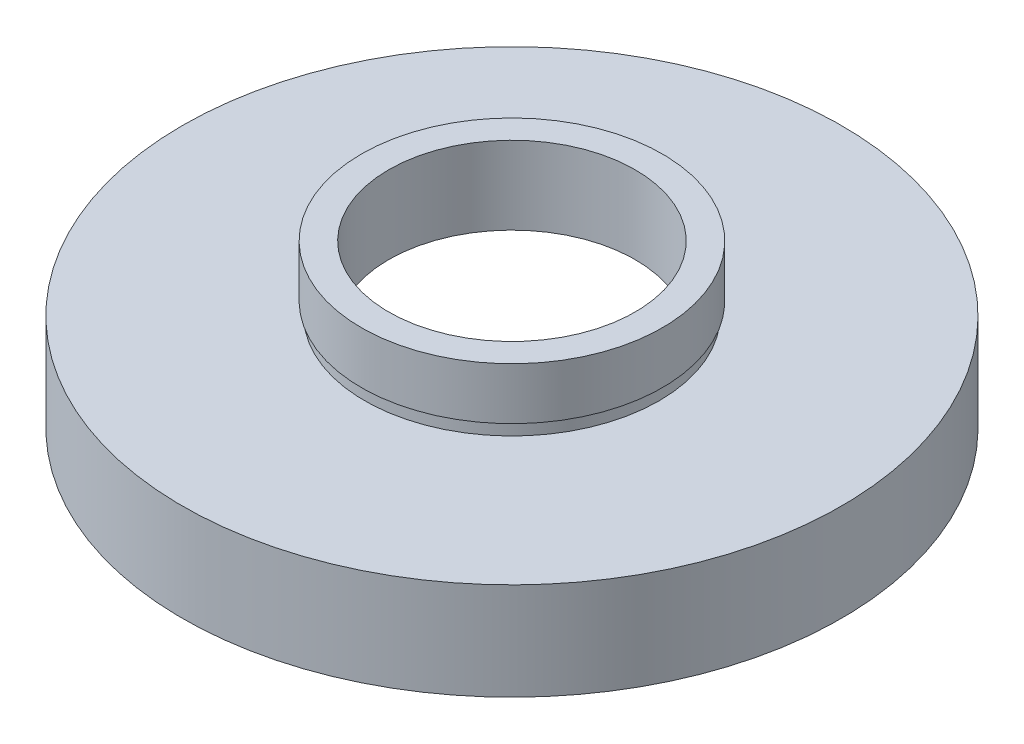
ISO-10303-21;
HEADER;
FILE_DESCRIPTION(('STEP AP214'),'2;1');
FILE_NAME('part.step','',(''),(''),'','','');
FILE_SCHEMA(('AUTOMOTIVE_DESIGN { 1 0 10303 214 1 1 1 1 }'));
ENDSEC;
DATA;
#1=APPLICATION_CONTEXT('core data for automotive mechanical design processes');
#2=APPLICATION_PROTOCOL_DEFINITION('international standard','automotive_design',2000,#1);
#3=PRODUCT_CONTEXT('',#1,'mechanical');
#4=PRODUCT('Part','Part','',(#3));
#5=PRODUCT_RELATED_PRODUCT_CATEGORY('part','',(#4));
#6=PRODUCT_DEFINITION_FORMATION('','',#4);
#7=PRODUCT_DEFINITION_CONTEXT('part definition',#1,'design');
#8=PRODUCT_DEFINITION('design','',#6,#7);
#9=PRODUCT_DEFINITION_SHAPE('','',#8);
#10=(LENGTH_UNIT() NAMED_UNIT(*) SI_UNIT(.MILLI.,.METRE.));
#11=(NAMED_UNIT(*) PLANE_ANGLE_UNIT() SI_UNIT($,.RADIAN.));
#12=(NAMED_UNIT(*) SI_UNIT($,.STERADIAN.) SOLID_ANGLE_UNIT());
#13=UNCERTAINTY_MEASURE_WITH_UNIT(LENGTH_MEASURE(1.E-05),#10,'distance_accuracy_value','');
#14=(GEOMETRIC_REPRESENTATION_CONTEXT(3) GLOBAL_UNCERTAINTY_ASSIGNED_CONTEXT((#13)) GLOBAL_UNIT_ASSIGNED_CONTEXT((#10,
#11,#12)) REPRESENTATION_CONTEXT('',''));
#15=CARTESIAN_POINT('',(0.,0.,0.));
#16=DIRECTION('',(0.,0.,1.));
#17=DIRECTION('',(1.,0.,0.));
#18=AXIS2_PLACEMENT_3D('',#15,#16,#17);
#19=CARTESIAN_POINT('',(25.4,0.,0.));
#20=DIRECTION('',(0.,1.,0.));
#21=DIRECTION('',(-1.,0.,0.));
#22=AXIS2_PLACEMENT_3D('',#19,#20,#21);
#23=PLANE('',#22);
#24=CARTESIAN_POINT('',(0.,0.,0.));
#25=DIRECTION('',(0.,1.,0.));
#26=DIRECTION('',(-1.,0.,0.));
#27=AXIS2_PLACEMENT_3D('',#24,#25,#26);
#28=CIRCLE('',#27,25.4);
#29=CARTESIAN_POINT('',(-25.4,0.,0.));
#30=VERTEX_POINT('',#29);
#31=EDGE_CURVE('E75',#30,#30,#28,.T.);
#32=ORIENTED_EDGE('',*,*,#31,.F.);
#33=EDGE_LOOP('',(#32));
#34=FACE_BOUND('',#33,.T.);
#35=CARTESIAN_POINT('',(0.,0.,0.));
#36=DIRECTION('',(0.,1.,0.));
#37=DIRECTION('',(-1.,0.,0.));
#38=AXIS2_PLACEMENT_3D('',#35,#36,#37);
#39=CIRCLE('',#38,20.5);
#40=CARTESIAN_POINT('',(-20.5,0.,0.));
#41=VERTEX_POINT('',#40);
#42=EDGE_CURVE('E10',#41,#41,#39,.T.);
#43=ORIENTED_EDGE('',*,*,#42,.T.);
#44=EDGE_LOOP('',(#43));
#45=FACE_BOUND('',#44,.T.);
#46=ADVANCED_FACE('F35',(#34,#45),#23,.F.);
#47=CARTESIAN_POINT('',(0.,16.8860182370821,0.));
#48=DIRECTION('',(0.,1.,0.));
#49=DIRECTION('',(-1.,0.,0.));
#50=AXIS2_PLACEMENT_3D('',#47,#48,#49);
#51=CYLINDRICAL_SURFACE('',#50,20.5);
#52=ORIENTED_EDGE('',*,*,#42,.F.);
#53=EDGE_LOOP('',(#52));
#54=FACE_BOUND('',#53,.T.);
#55=CARTESIAN_POINT('',(0.,5.5,0.));
#56=DIRECTION('',(0.,1.,0.));
#57=DIRECTION('',(-1.,0.,0.));
#58=AXIS2_PLACEMENT_3D('',#55,#56,#57);
#59=CIRCLE('',#58,20.5);
#60=CARTESIAN_POINT('',(-20.5,5.5,0.));
#61=VERTEX_POINT('',#60);
#62=EDGE_CURVE('E41',#61,#61,#59,.T.);
#63=ORIENTED_EDGE('',*,*,#62,.T.);
#64=EDGE_LOOP('',(#63));
#65=FACE_BOUND('',#64,.T.);
#66=ADVANCED_FACE('F82',(#54,#65),#51,.F.);
#67=CARTESIAN_POINT('',(20.5,5.5,0.));
#68=DIRECTION('',(0.,-1.,0.));
#69=DIRECTION('',(1.,0.,0.));
#70=AXIS2_PLACEMENT_3D('',#67,#68,#69);
#71=PLANE('',#70);
#72=ORIENTED_EDGE('',*,*,#62,.F.);
#73=EDGE_LOOP('',(#72));
#74=FACE_BOUND('',#73,.T.);
#75=CARTESIAN_POINT('',(0.,5.5,0.));
#76=DIRECTION('',(0.,1.,0.));
#77=DIRECTION('',(-1.,0.,0.));
#78=AXIS2_PLACEMENT_3D('',#75,#76,#77);
#79=CIRCLE('',#78,21.1);
#80=CARTESIAN_POINT('',(-21.1,5.49999999999999,0.));
#81=VERTEX_POINT('',#80);
#82=EDGE_CURVE('E45',#81,#81,#79,.T.);
#83=ORIENTED_EDGE('',*,*,#82,.T.);
#84=EDGE_LOOP('',(#83));
#85=FACE_BOUND('',#84,.T.);
#86=ADVANCED_FACE('F86',(#74,#85),#71,.F.);
#87=CARTESIAN_POINT('',(0.,16.8860182370821,0.));
#88=DIRECTION('',(0.,1.,0.));
#89=DIRECTION('',(-1.,0.,0.));
#90=AXIS2_PLACEMENT_3D('',#87,#88,#89);
#91=CYLINDRICAL_SURFACE('',#90,21.1);
#92=ORIENTED_EDGE('',*,*,#82,.F.);
#93=EDGE_LOOP('',(#92));
#94=FACE_BOUND('',#93,.T.);
#95=CARTESIAN_POINT('',(0.,6.5,0.));
#96=DIRECTION('',(0.,1.,0.));
#97=DIRECTION('',(-1.,0.,0.));
#98=AXIS2_PLACEMENT_3D('',#95,#96,#97);
#99=CIRCLE('',#98,21.1);
#100=CARTESIAN_POINT('',(-21.1,6.49999999999999,0.));
#101=VERTEX_POINT('',#100);
#102=EDGE_CURVE('E49',#101,#101,#99,.T.);
#103=ORIENTED_EDGE('',*,*,#102,.T.);
#104=EDGE_LOOP('',(#103));
#105=FACE_BOUND('',#104,.T.);
#106=ADVANCED_FACE('F91',(#94,#105),#91,.F.);
#107=CARTESIAN_POINT('',(9.5,6.5,0.));
#108=DIRECTION('',(0.,1.,0.));
#109=DIRECTION('',(-1.,0.,0.));
#110=AXIS2_PLACEMENT_3D('',#107,#108,#109);
#111=PLANE('',#110);
#112=ORIENTED_EDGE('',*,*,#102,.F.);
#113=EDGE_LOOP('',(#112));
#114=FACE_BOUND('',#113,.T.);
#115=CARTESIAN_POINT('',(0.,6.5,0.));
#116=DIRECTION('',(0.,1.,0.));
#117=DIRECTION('',(-1.,0.,0.));
#118=AXIS2_PLACEMENT_3D('',#115,#116,#117);
#119=CIRCLE('',#118,9.5);
#120=CARTESIAN_POINT('',(-9.5,6.5,0.));
#121=VERTEX_POINT('',#120);
#122=EDGE_CURVE('E54',#121,#121,#119,.T.);
#123=ORIENTED_EDGE('',*,*,#122,.T.);
#124=EDGE_LOOP('',(#123));
#125=FACE_BOUND('',#124,.T.);
#126=ADVANCED_FACE('F97',(#114,#125),#111,.F.);
#127=CARTESIAN_POINT('',(0.,16.8860182370821,0.));
#128=DIRECTION('',(0.,1.,0.));
#129=DIRECTION('',(-1.,0.,0.));
#130=AXIS2_PLACEMENT_3D('',#127,#128,#129);
#131=CYLINDRICAL_SURFACE('',#130,9.5);
#132=ORIENTED_EDGE('',*,*,#122,.F.);
#133=EDGE_LOOP('',(#132));
#134=FACE_BOUND('',#133,.T.);
#135=CARTESIAN_POINT('',(0.,12.5,0.));
#136=DIRECTION('',(0.,1.,0.));
#137=DIRECTION('',(-1.,0.,0.));
#138=AXIS2_PLACEMENT_3D('',#135,#136,#137);
#139=CIRCLE('',#138,9.5);
#140=CARTESIAN_POINT('',(-9.5,12.5,0.));
#141=VERTEX_POINT('',#140);
#142=EDGE_CURVE('E57',#141,#141,#139,.T.);
#143=ORIENTED_EDGE('',*,*,#142,.T.);
#144=EDGE_LOOP('',(#143));
#145=FACE_BOUND('',#144,.T.);
#146=ADVANCED_FACE('F101',(#134,#145),#131,.F.);
#147=CARTESIAN_POINT('',(9.5,12.5,0.));
#148=DIRECTION('',(0.,-1.,0.));
#149=DIRECTION('',(1.,0.,0.));
#150=AXIS2_PLACEMENT_3D('',#147,#148,#149);
#151=PLANE('',#150);
#152=ORIENTED_EDGE('',*,*,#142,.F.);
#153=EDGE_LOOP('',(#152));
#154=FACE_BOUND('',#153,.T.);
#155=CARTESIAN_POINT('',(0.,12.5,0.));
#156=DIRECTION('',(0.,1.,0.));
#157=DIRECTION('',(-1.,0.,0.));
#158=AXIS2_PLACEMENT_3D('',#155,#156,#157);
#159=CIRCLE('',#158,11.6);
#160=CARTESIAN_POINT('',(-11.6,12.5,0.));
#161=VERTEX_POINT('',#160);
#162=EDGE_CURVE('E60',#161,#161,#159,.T.);
#163=ORIENTED_EDGE('',*,*,#162,.T.);
#164=EDGE_LOOP('',(#163));
#165=FACE_BOUND('',#164,.T.);
#166=ADVANCED_FACE('F105',(#154,#165),#151,.F.);
#167=CARTESIAN_POINT('',(0.,16.8860182370821,0.));
#168=DIRECTION('',(0.,1.,0.));
#169=DIRECTION('',(-1.,0.,0.));
#170=AXIS2_PLACEMENT_3D('',#167,#168,#169);
#171=CYLINDRICAL_SURFACE('',#170,11.6);
#172=ORIENTED_EDGE('',*,*,#162,.F.);
#173=EDGE_LOOP('',(#172));
#174=FACE_BOUND('',#173,.T.);
#175=CARTESIAN_POINT('',(0.,8.5,0.));
#176=DIRECTION('',(0.,1.,0.));
#177=DIRECTION('',(-1.,0.,0.));
#178=AXIS2_PLACEMENT_3D('',#175,#176,#177);
#179=CIRCLE('',#178,11.6);
#180=CARTESIAN_POINT('',(-11.6,8.5,0.));
#181=VERTEX_POINT('',#180);
#182=EDGE_CURVE('E63',#181,#181,#179,.T.);
#183=ORIENTED_EDGE('',*,*,#182,.T.);
#184=EDGE_LOOP('',(#183));
#185=FACE_BOUND('',#184,.T.);
#186=ADVANCED_FACE('F109',(#174,#185),#171,.T.);
#187=CARTESIAN_POINT('',(11.6,8.5,0.));
#188=DIRECTION('',(0.,1.,0.));
#189=DIRECTION('',(-1.,0.,0.));
#190=AXIS2_PLACEMENT_3D('',#187,#188,#189);
#191=PLANE('',#190);
#192=ORIENTED_EDGE('',*,*,#182,.F.);
#193=EDGE_LOOP('',(#192));
#194=FACE_BOUND('',#193,.T.);
#195=CARTESIAN_POINT('',(0.,8.5,0.));
#196=DIRECTION('',(0.,1.,0.));
#197=DIRECTION('',(-1.,0.,0.));
#198=AXIS2_PLACEMENT_3D('',#195,#196,#197);
#199=CIRCLE('',#198,11.35);
#200=CARTESIAN_POINT('',(-11.35,8.5,0.));
#201=VERTEX_POINT('',#200);
#202=EDGE_CURVE('E66',#201,#201,#199,.T.);
#203=ORIENTED_EDGE('',*,*,#202,.T.);
#204=EDGE_LOOP('',(#203));
#205=FACE_BOUND('',#204,.T.);
#206=ADVANCED_FACE('F113',(#194,#205),#191,.F.);
#207=CARTESIAN_POINT('',(0.,16.8860182370821,0.));
#208=DIRECTION('',(0.,1.,0.));
#209=DIRECTION('',(-1.,0.,0.));
#210=AXIS2_PLACEMENT_3D('',#207,#208,#209);
#211=CYLINDRICAL_SURFACE('',#210,11.35);
#212=ORIENTED_EDGE('',*,*,#202,.F.);
#213=EDGE_LOOP('',(#212));
#214=FACE_BOUND('',#213,.T.);
#215=CARTESIAN_POINT('',(0.,7.5,0.));
#216=DIRECTION('',(0.,1.,0.));
#217=DIRECTION('',(-1.,0.,0.));
#218=AXIS2_PLACEMENT_3D('',#215,#216,#217);
#219=CIRCLE('',#218,11.35);
#220=CARTESIAN_POINT('',(-11.35,7.5,0.));
#221=VERTEX_POINT('',#220);
#222=EDGE_CURVE('E69',#221,#221,#219,.T.);
#223=ORIENTED_EDGE('',*,*,#222,.T.);
#224=EDGE_LOOP('',(#223));
#225=FACE_BOUND('',#224,.T.);
#226=ADVANCED_FACE('F117',(#214,#225),#211,.T.);
#227=CARTESIAN_POINT('',(11.35,7.5,0.));
#228=DIRECTION('',(0.,-1.,0.));
#229=DIRECTION('',(1.,0.,0.));
#230=AXIS2_PLACEMENT_3D('',#227,#228,#229);
#231=PLANE('',#230);
#232=ORIENTED_EDGE('',*,*,#222,.F.);
#233=EDGE_LOOP('',(#232));
#234=FACE_BOUND('',#233,.T.);
#235=CARTESIAN_POINT('',(0.,7.5,0.));
#236=DIRECTION('',(0.,1.,0.));
#237=DIRECTION('',(-1.,0.,0.));
#238=AXIS2_PLACEMENT_3D('',#235,#236,#237);
#239=CIRCLE('',#238,25.4);
#240=CARTESIAN_POINT('',(-25.4,7.49999999999999,0.));
#241=VERTEX_POINT('',#240);
#242=EDGE_CURVE('E72',#241,#241,#239,.T.);
#243=ORIENTED_EDGE('',*,*,#242,.T.);
#244=EDGE_LOOP('',(#243));
#245=FACE_BOUND('',#244,.T.);
#246=ADVANCED_FACE('F121',(#234,#245),#231,.F.);
#247=CARTESIAN_POINT('',(0.,16.8860182370821,0.));
#248=DIRECTION('',(0.,1.,0.));
#249=DIRECTION('',(-1.,0.,0.));
#250=AXIS2_PLACEMENT_3D('',#247,#248,#249);
#251=CYLINDRICAL_SURFACE('',#250,25.4);
#252=ORIENTED_EDGE('',*,*,#242,.F.);
#253=EDGE_LOOP('',(#252));
#254=FACE_BOUND('',#253,.T.);
#255=ORIENTED_EDGE('',*,*,#31,.T.);
#256=EDGE_LOOP('',(#255));
#257=FACE_BOUND('',#256,.T.);
#258=ADVANCED_FACE('F79',(#254,#257),#251,.T.);
#259=CLOSED_SHELL('',(#46,#66,#86,#106,#126,#146,#166,#186,#206,#226,#246,#258));
#260=MANIFOLD_SOLID_BREP('B2',#259);
#261=ADVANCED_BREP_SHAPE_REPRESENTATION('',(#18,#260),#14);
#262=SHAPE_DEFINITION_REPRESENTATION(#9,#261);
ENDSEC;
END-ISO-10303-21;
